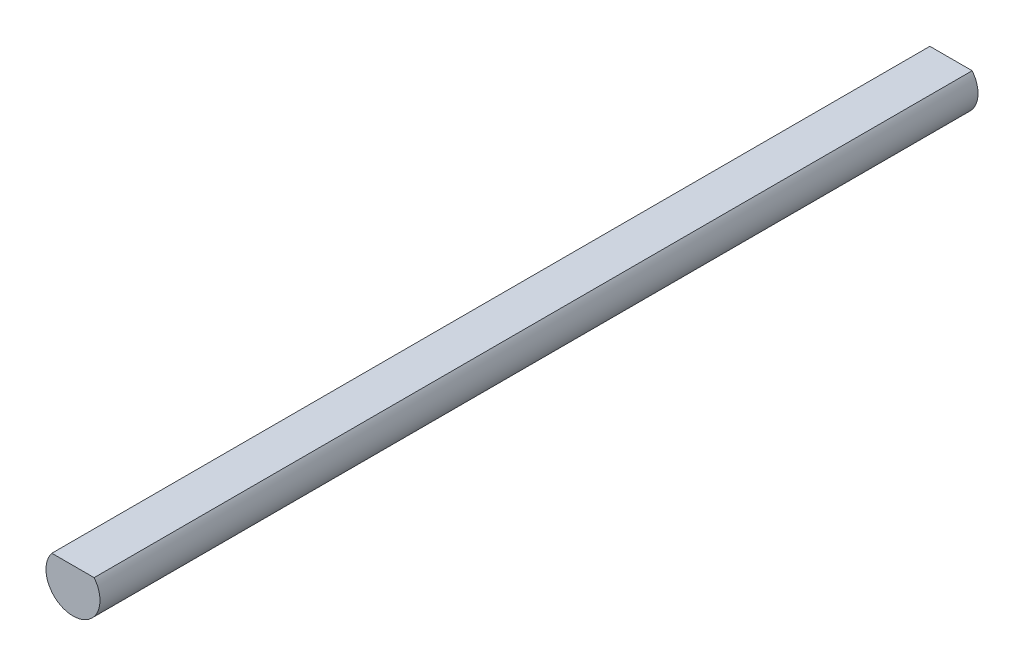
ISO-10303-21;
HEADER;
FILE_DESCRIPTION(('STEP AP214'),'2;1');
FILE_NAME('part.step','',(''),(''),'','','');
FILE_SCHEMA(('AUTOMOTIVE_DESIGN { 1 0 10303 214 1 1 1 1 }'));
ENDSEC;
DATA;
#1=APPLICATION_CONTEXT('core data for automotive mechanical design processes');
#2=APPLICATION_PROTOCOL_DEFINITION('international standard','automotive_design',2000,#1);
#3=PRODUCT_CONTEXT('',#1,'mechanical');
#4=PRODUCT('Part','Part','',(#3));
#5=PRODUCT_RELATED_PRODUCT_CATEGORY('part','',(#4));
#6=PRODUCT_DEFINITION_FORMATION('','',#4);
#7=PRODUCT_DEFINITION_CONTEXT('part definition',#1,'design');
#8=PRODUCT_DEFINITION('design','',#6,#7);
#9=PRODUCT_DEFINITION_SHAPE('','',#8);
#10=(LENGTH_UNIT() NAMED_UNIT(*) SI_UNIT(.MILLI.,.METRE.));
#11=(NAMED_UNIT(*) PLANE_ANGLE_UNIT() SI_UNIT($,.RADIAN.));
#12=(NAMED_UNIT(*) SI_UNIT($,.STERADIAN.) SOLID_ANGLE_UNIT());
#13=UNCERTAINTY_MEASURE_WITH_UNIT(LENGTH_MEASURE(1.E-05),#10,'distance_accuracy_value','');
#14=(GEOMETRIC_REPRESENTATION_CONTEXT(3) GLOBAL_UNCERTAINTY_ASSIGNED_CONTEXT((#13)) GLOBAL_UNIT_ASSIGNED_CONTEXT((#10,
#11,#12)) REPRESENTATION_CONTEXT('',''));
#15=CARTESIAN_POINT('',(0.,0.,0.));
#16=DIRECTION('',(0.,0.,1.));
#17=DIRECTION('',(1.,0.,0.));
#18=AXIS2_PLACEMENT_3D('',#15,#16,#17);
#19=CARTESIAN_POINT('',(0.,0.,130.));
#20=DIRECTION('',(0.,0.,-1.));
#21=DIRECTION('',(-1.,0.,0.));
#22=AXIS2_PLACEMENT_3D('',#19,#20,#21);
#23=CYLINDRICAL_SURFACE('',#22,4.);
#24=CARTESIAN_POINT('',(0.,0.,130.));
#25=DIRECTION('',(0.,0.,1.));
#26=DIRECTION('',(1.,0.,0.));
#27=AXIS2_PLACEMENT_3D('',#24,#25,#26);
#28=CIRCLE('',#27,4.);
#29=CARTESIAN_POINT('',(-3.1309992829753,2.48934599644327,130.));
#30=VERTEX_POINT('',#29);
#31=CARTESIAN_POINT('',(3.1309992829753,2.48934599644327,130.));
#32=VERTEX_POINT('',#31);
#33=EDGE_CURVE('E11',#30,#32,#28,.T.);
#34=ORIENTED_EDGE('',*,*,#33,.F.);
#35=DIRECTION('',(0.,0.,1.));
#36=VECTOR('',#35,1.);
#37=CARTESIAN_POINT('',(-3.1309992829753,2.48934599644327,0.));
#38=LINE('',#37,#36);
#39=CARTESIAN_POINT('',(-3.1309992829753,2.48934599644327,0.));
#40=VERTEX_POINT('',#39);
#41=EDGE_CURVE('E74',#40,#30,#38,.T.);
#42=ORIENTED_EDGE('',*,*,#41,.F.);
#43=CARTESIAN_POINT('',(0.,0.,0.));
#44=DIRECTION('',(0.,0.,1.));
#45=DIRECTION('',(1.,0.,0.));
#46=AXIS2_PLACEMENT_3D('',#43,#44,#45);
#47=CIRCLE('',#46,4.);
#48=CARTESIAN_POINT('',(3.1309992829753,2.48934599644327,0.));
#49=VERTEX_POINT('',#48);
#50=EDGE_CURVE('E59',#40,#49,#47,.T.);
#51=ORIENTED_EDGE('',*,*,#50,.T.);
#52=DIRECTION('',(0.,0.,1.));
#53=VECTOR('',#52,1.);
#54=CARTESIAN_POINT('',(3.1309992829753,2.48934599644327,0.));
#55=LINE('',#54,#53);
#56=EDGE_CURVE('E67',#49,#32,#55,.T.);
#57=ORIENTED_EDGE('',*,*,#56,.T.);
#58=EDGE_LOOP('',(#34,#42,#51,#57));
#59=FACE_BOUND('',#58,.T.);
#60=ADVANCED_FACE('F49',(#59),#23,.T.);
#61=CARTESIAN_POINT('',(0.,0.,130.));
#62=DIRECTION('',(0.,0.,1.));
#63=DIRECTION('',(1.,0.,0.));
#64=AXIS2_PLACEMENT_3D('',#61,#62,#63);
#65=PLANE('',#64);
#66=DIRECTION('',(1.,0.,0.));
#67=VECTOR('',#66,1.);
#68=CARTESIAN_POINT('',(-3.1309992829753,2.48934599644327,130.));
#69=LINE('',#68,#67);
#70=EDGE_CURVE('E52',#30,#32,#69,.T.);
#71=ORIENTED_EDGE('',*,*,#70,.F.);
#72=ORIENTED_EDGE('',*,*,#33,.T.);
#73=EDGE_LOOP('',(#71,#72));
#74=FACE_BOUND('',#73,.T.);
#75=ADVANCED_FACE('F95',(#74),#65,.T.);
#76=CARTESIAN_POINT('',(0.,0.,0.));
#77=DIRECTION('',(0.,0.,1.));
#78=DIRECTION('',(1.,0.,0.));
#79=AXIS2_PLACEMENT_3D('',#76,#77,#78);
#80=PLANE('',#79);
#81=ORIENTED_EDGE('',*,*,#50,.F.);
#82=DIRECTION('',(1.,0.,0.));
#83=VECTOR('',#82,1.);
#84=CARTESIAN_POINT('',(-3.1309992829753,2.48934599644327,0.));
#85=LINE('',#84,#83);
#86=EDGE_CURVE('E76',#40,#49,#85,.T.);
#87=ORIENTED_EDGE('',*,*,#86,.T.);
#88=EDGE_LOOP('',(#81,#87));
#89=FACE_BOUND('',#88,.T.);
#90=ADVANCED_FACE('F87',(#89),#80,.F.);
#91=CARTESIAN_POINT('',(-3.1309992829753,2.48934599644327,0.));
#92=DIRECTION('',(0.,-1.,0.));
#93=DIRECTION('',(0.,0.,-1.));
#94=AXIS2_PLACEMENT_3D('',#91,#92,#93);
#95=PLANE('',#94);
#96=ORIENTED_EDGE('',*,*,#70,.T.);
#97=ORIENTED_EDGE('',*,*,#56,.F.);
#98=ORIENTED_EDGE('',*,*,#86,.F.);
#99=ORIENTED_EDGE('',*,*,#41,.T.);
#100=EDGE_LOOP('',(#96,#97,#98,#99));
#101=FACE_BOUND('',#100,.T.);
#102=ADVANCED_FACE('F77',(#101),#95,.F.);
#103=CLOSED_SHELL('',(#60,#75,#90,#102));
#104=MANIFOLD_SOLID_BREP('B2',#103);
#105=ADVANCED_BREP_SHAPE_REPRESENTATION('',(#18,#104),#14);
#106=SHAPE_DEFINITION_REPRESENTATION(#9,#105);
ENDSEC;
END-ISO-10303-21;
